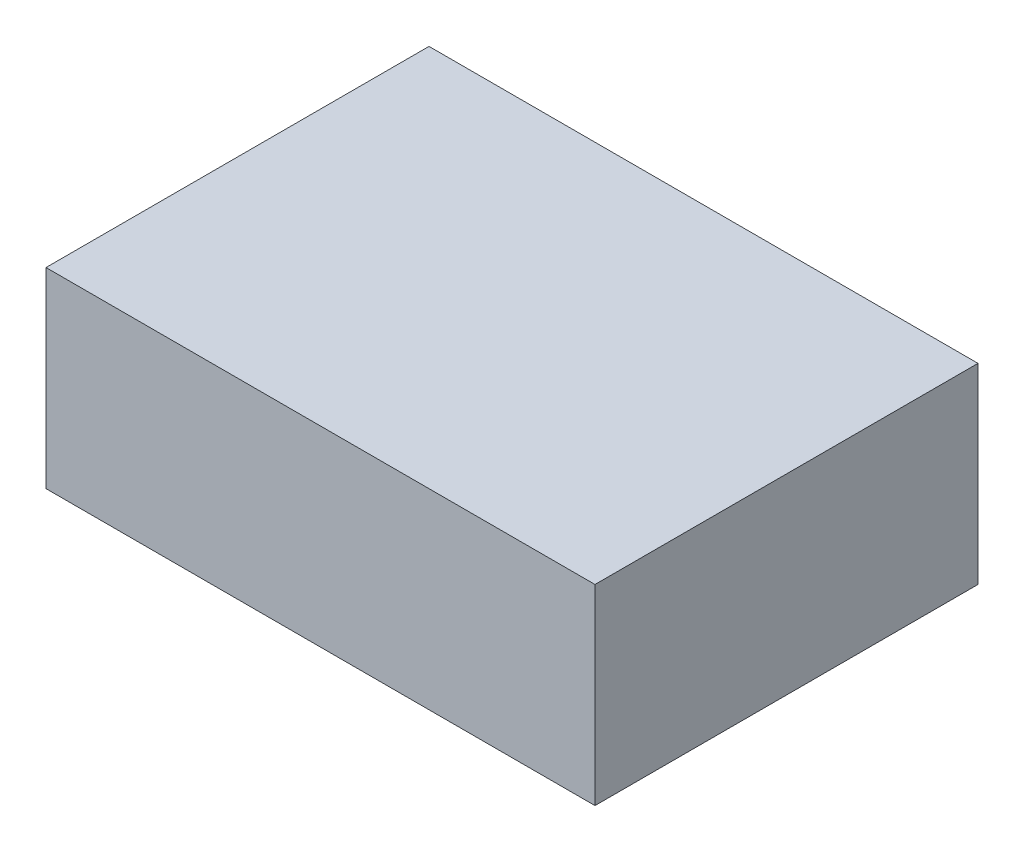
ISO-10303-21;
HEADER;
FILE_DESCRIPTION(('STEP AP214'),'2;1');
FILE_NAME('part.step','',(''),(''),'','','');
FILE_SCHEMA(('AUTOMOTIVE_DESIGN { 1 0 10303 214 1 1 1 1 }'));
ENDSEC;
DATA;
#1=APPLICATION_CONTEXT('core data for automotive mechanical design processes');
#2=APPLICATION_PROTOCOL_DEFINITION('international standard','automotive_design',2000,#1);
#3=PRODUCT_CONTEXT('',#1,'mechanical');
#4=PRODUCT('Part','Part','',(#3));
#5=PRODUCT_RELATED_PRODUCT_CATEGORY('part','',(#4));
#6=PRODUCT_DEFINITION_FORMATION('','',#4);
#7=PRODUCT_DEFINITION_CONTEXT('part definition',#1,'design');
#8=PRODUCT_DEFINITION('design','',#6,#7);
#9=PRODUCT_DEFINITION_SHAPE('','',#8);
#10=(LENGTH_UNIT() NAMED_UNIT(*) SI_UNIT(.MILLI.,.METRE.));
#11=(NAMED_UNIT(*) PLANE_ANGLE_UNIT() SI_UNIT($,.RADIAN.));
#12=(NAMED_UNIT(*) SI_UNIT($,.STERADIAN.) SOLID_ANGLE_UNIT());
#13=UNCERTAINTY_MEASURE_WITH_UNIT(LENGTH_MEASURE(1.E-05),#10,'distance_accuracy_value','');
#14=(GEOMETRIC_REPRESENTATION_CONTEXT(3) GLOBAL_UNCERTAINTY_ASSIGNED_CONTEXT((#13)) GLOBAL_UNIT_ASSIGNED_CONTEXT((#10,
#11,#12)) REPRESENTATION_CONTEXT('',''));
#15=CARTESIAN_POINT('',(0.,0.,0.));
#16=DIRECTION('',(0.,0.,1.));
#17=DIRECTION('',(1.,0.,0.));
#18=AXIS2_PLACEMENT_3D('',#15,#16,#17);
#19=CARTESIAN_POINT('',(0.,15.,0.));
#20=DIRECTION('',(1.,0.,0.));
#21=DIRECTION('',(0.,0.,-1.));
#22=AXIS2_PLACEMENT_3D('',#19,#20,#21);
#23=PLANE('',#22);
#24=DIRECTION('',(0.,0.,1.));
#25=VECTOR('',#24,1.);
#26=CARTESIAN_POINT('',(0.,0.,0.));
#27=LINE('',#26,#25);
#28=CARTESIAN_POINT('',(0.,0.,-30.));
#29=VERTEX_POINT('',#28);
#30=CARTESIAN_POINT('',(0.,0.,0.));
#31=VERTEX_POINT('',#30);
#32=EDGE_CURVE('E111',#29,#31,#27,.T.);
#33=ORIENTED_EDGE('',*,*,#32,.T.);
#34=DIRECTION('',(0.,-1.,0.));
#35=VECTOR('',#34,1.);
#36=CARTESIAN_POINT('',(0.,15.,0.));
#37=LINE('',#36,#35);
#38=CARTESIAN_POINT('',(0.,15.,0.));
#39=VERTEX_POINT('',#38);
#40=EDGE_CURVE('E11',#39,#31,#37,.T.);
#41=ORIENTED_EDGE('',*,*,#40,.F.);
#42=DIRECTION('',(0.,0.,1.));
#43=VECTOR('',#42,1.);
#44=CARTESIAN_POINT('',(0.,15.,0.));
#45=LINE('',#44,#43);
#46=CARTESIAN_POINT('',(0.,15.,-30.));
#47=VERTEX_POINT('',#46);
#48=EDGE_CURVE('E95',#47,#39,#45,.T.);
#49=ORIENTED_EDGE('',*,*,#48,.F.);
#50=DIRECTION('',(0.,-1.,0.));
#51=VECTOR('',#50,1.);
#52=CARTESIAN_POINT('',(0.,15.,-30.));
#53=LINE('',#52,#51);
#54=EDGE_CURVE('E107',#47,#29,#53,.T.);
#55=ORIENTED_EDGE('',*,*,#54,.T.);
#56=EDGE_LOOP('',(#33,#41,#49,#55));
#57=FACE_BOUND('',#56,.T.);
#58=ADVANCED_FACE('F43',(#57),#23,.F.);
#59=CARTESIAN_POINT('',(0.,15.,0.));
#60=DIRECTION('',(0.,0.,-1.));
#61=DIRECTION('',(-1.,0.,0.));
#62=AXIS2_PLACEMENT_3D('',#59,#60,#61);
#63=PLANE('',#62);
#64=DIRECTION('',(1.,0.,0.));
#65=VECTOR('',#64,1.);
#66=CARTESIAN_POINT('',(0.,0.,0.));
#67=LINE('',#66,#65);
#68=CARTESIAN_POINT('',(43.,0.,0.));
#69=VERTEX_POINT('',#68);
#70=EDGE_CURVE('E100',#31,#69,#67,.T.);
#71=ORIENTED_EDGE('',*,*,#70,.T.);
#72=DIRECTION('',(0.,-1.,0.));
#73=VECTOR('',#72,1.);
#74=CARTESIAN_POINT('',(43.,15.,0.));
#75=LINE('',#74,#73);
#76=CARTESIAN_POINT('',(43.,15.,0.));
#77=VERTEX_POINT('',#76);
#78=EDGE_CURVE('E52',#77,#69,#75,.T.);
#79=ORIENTED_EDGE('',*,*,#78,.F.);
#80=DIRECTION('',(1.,0.,0.));
#81=VECTOR('',#80,1.);
#82=CARTESIAN_POINT('',(0.,15.,0.));
#83=LINE('',#82,#81);
#84=EDGE_CURVE('E90',#39,#77,#83,.T.);
#85=ORIENTED_EDGE('',*,*,#84,.F.);
#86=ORIENTED_EDGE('',*,*,#40,.T.);
#87=EDGE_LOOP('',(#71,#79,#85,#86));
#88=FACE_BOUND('',#87,.T.);
#89=ADVANCED_FACE('F99',(#88),#63,.F.);
#90=CARTESIAN_POINT('',(43.,15.,0.));
#91=DIRECTION('',(-1.,0.,0.));
#92=DIRECTION('',(0.,0.,1.));
#93=AXIS2_PLACEMENT_3D('',#90,#91,#92);
#94=PLANE('',#93);
#95=DIRECTION('',(0.,0.,-1.));
#96=VECTOR('',#95,1.);
#97=CARTESIAN_POINT('',(43.,0.,0.));
#98=LINE('',#97,#96);
#99=CARTESIAN_POINT('',(43.,0.,-30.));
#100=VERTEX_POINT('',#99);
#101=EDGE_CURVE('E77',#69,#100,#98,.T.);
#102=ORIENTED_EDGE('',*,*,#101,.T.);
#103=DIRECTION('',(0.,-1.,0.));
#104=VECTOR('',#103,1.);
#105=CARTESIAN_POINT('',(43.,15.,-30.));
#106=LINE('',#105,#104);
#107=CARTESIAN_POINT('',(43.,15.,-30.));
#108=VERTEX_POINT('',#107);
#109=EDGE_CURVE('E102',#108,#100,#106,.T.);
#110=ORIENTED_EDGE('',*,*,#109,.F.);
#111=DIRECTION('',(0.,0.,-1.));
#112=VECTOR('',#111,1.);
#113=CARTESIAN_POINT('',(43.,15.,0.));
#114=LINE('',#113,#112);
#115=EDGE_CURVE('E93',#77,#108,#114,.T.);
#116=ORIENTED_EDGE('',*,*,#115,.F.);
#117=ORIENTED_EDGE('',*,*,#78,.T.);
#118=EDGE_LOOP('',(#102,#110,#116,#117));
#119=FACE_BOUND('',#118,.T.);
#120=ADVANCED_FACE('F103',(#119),#94,.F.);
#121=CARTESIAN_POINT('',(0.,15.,-30.));
#122=DIRECTION('',(0.,0.,1.));
#123=DIRECTION('',(1.,0.,0.));
#124=AXIS2_PLACEMENT_3D('',#121,#122,#123);
#125=PLANE('',#124);
#126=DIRECTION('',(-1.,0.,0.));
#127=VECTOR('',#126,1.);
#128=CARTESIAN_POINT('',(0.,0.,-30.));
#129=LINE('',#128,#127);
#130=EDGE_CURVE('E83',#100,#29,#129,.T.);
#131=ORIENTED_EDGE('',*,*,#130,.T.);
#132=ORIENTED_EDGE('',*,*,#54,.F.);
#133=DIRECTION('',(-1.,0.,0.));
#134=VECTOR('',#133,1.);
#135=CARTESIAN_POINT('',(0.,15.,-30.));
#136=LINE('',#135,#134);
#137=EDGE_CURVE('E60',#108,#47,#136,.T.);
#138=ORIENTED_EDGE('',*,*,#137,.F.);
#139=ORIENTED_EDGE('',*,*,#109,.T.);
#140=EDGE_LOOP('',(#131,#132,#138,#139));
#141=FACE_BOUND('',#140,.T.);
#142=ADVANCED_FACE('F124',(#141),#125,.F.);
#143=CARTESIAN_POINT('',(0.,15.,0.));
#144=DIRECTION('',(0.,-1.,0.));
#145=DIRECTION('',(0.,0.,-1.));
#146=AXIS2_PLACEMENT_3D('',#143,#144,#145);
#147=PLANE('',#146);
#148=ORIENTED_EDGE('',*,*,#48,.T.);
#149=ORIENTED_EDGE('',*,*,#84,.T.);
#150=ORIENTED_EDGE('',*,*,#115,.T.);
#151=ORIENTED_EDGE('',*,*,#137,.T.);
#152=EDGE_LOOP('',(#148,#149,#150,#151));
#153=FACE_BOUND('',#152,.T.);
#154=ADVANCED_FACE('F91',(#153),#147,.F.);
#155=CARTESIAN_POINT('',(0.,0.,0.));
#156=DIRECTION('',(0.,-1.,0.));
#157=DIRECTION('',(0.,0.,-1.));
#158=AXIS2_PLACEMENT_3D('',#155,#156,#157);
#159=PLANE('',#158);
#160=ORIENTED_EDGE('',*,*,#32,.F.);
#161=ORIENTED_EDGE('',*,*,#130,.F.);
#162=ORIENTED_EDGE('',*,*,#101,.F.);
#163=ORIENTED_EDGE('',*,*,#70,.F.);
#164=EDGE_LOOP('',(#160,#161,#162,#163));
#165=FACE_BOUND('',#164,.T.);
#166=ADVANCED_FACE('F127',(#165),#159,.T.);
#167=CLOSED_SHELL('',(#58,#89,#120,#142,#154,#166));
#168=MANIFOLD_SOLID_BREP('B2',#167);
#169=ADVANCED_BREP_SHAPE_REPRESENTATION('',(#18,#168),#14);
#170=SHAPE_DEFINITION_REPRESENTATION(#9,#169);
ENDSEC;
END-ISO-10303-21;
